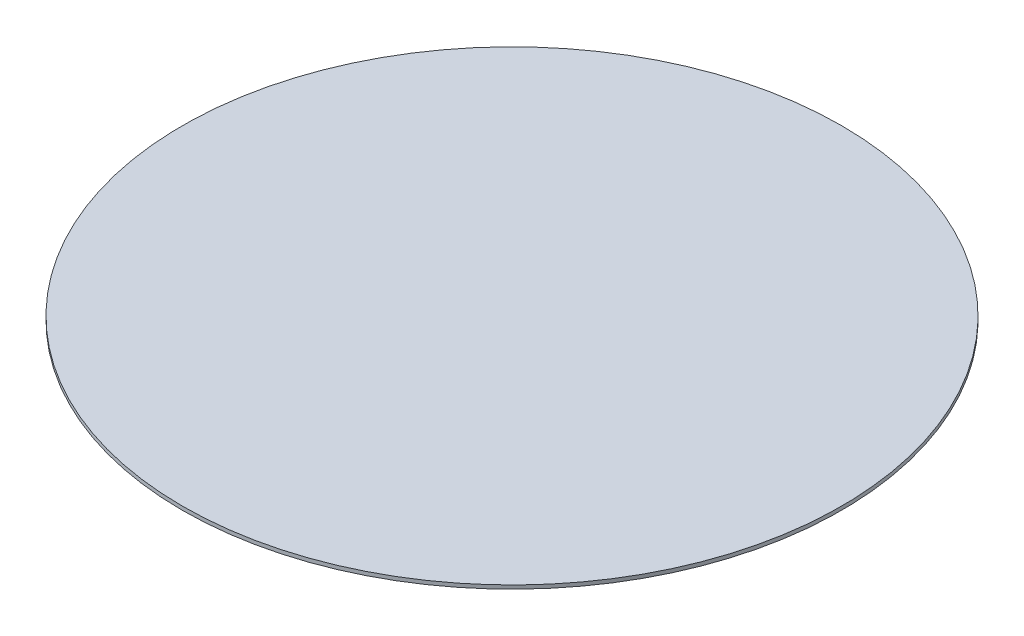
ISO-10303-21;
HEADER;
FILE_DESCRIPTION(('STEP AP214'),'2;1');
FILE_NAME('part.step','',(''),(''),'','','');
FILE_SCHEMA(('AUTOMOTIVE_DESIGN { 1 0 10303 214 1 1 1 1 }'));
ENDSEC;
DATA;
#1=APPLICATION_CONTEXT('core data for automotive mechanical design processes');
#2=APPLICATION_PROTOCOL_DEFINITION('international standard','automotive_design',2000,#1);
#3=PRODUCT_CONTEXT('',#1,'mechanical');
#4=PRODUCT('Part','Part','',(#3));
#5=PRODUCT_RELATED_PRODUCT_CATEGORY('part','',(#4));
#6=PRODUCT_DEFINITION_FORMATION('','',#4);
#7=PRODUCT_DEFINITION_CONTEXT('part definition',#1,'design');
#8=PRODUCT_DEFINITION('design','',#6,#7);
#9=PRODUCT_DEFINITION_SHAPE('','',#8);
#10=(LENGTH_UNIT() NAMED_UNIT(*) SI_UNIT(.MILLI.,.METRE.));
#11=(NAMED_UNIT(*) PLANE_ANGLE_UNIT() SI_UNIT($,.RADIAN.));
#12=(NAMED_UNIT(*) SI_UNIT($,.STERADIAN.) SOLID_ANGLE_UNIT());
#13=UNCERTAINTY_MEASURE_WITH_UNIT(LENGTH_MEASURE(1.E-05),#10,'distance_accuracy_value','');
#14=(GEOMETRIC_REPRESENTATION_CONTEXT(3) GLOBAL_UNCERTAINTY_ASSIGNED_CONTEXT((#13)) GLOBAL_UNIT_ASSIGNED_CONTEXT((#10,
#11,#12)) REPRESENTATION_CONTEXT('',''));
#15=CARTESIAN_POINT('',(0.,0.,0.));
#16=DIRECTION('',(0.,0.,1.));
#17=DIRECTION('',(1.,0.,0.));
#18=AXIS2_PLACEMENT_3D('',#15,#16,#17);
#19=CARTESIAN_POINT('',(0.,1.,0.));
#20=DIRECTION('',(0.,-1.,0.));
#21=DIRECTION('',(0.,0.,-1.));
#22=AXIS2_PLACEMENT_3D('',#19,#20,#21);
#23=CYLINDRICAL_SURFACE('',#22,90.);
#24=CARTESIAN_POINT('',(0.,1.,0.));
#25=DIRECTION('',(0.,1.,0.));
#26=DIRECTION('',(0.,0.,1.));
#27=AXIS2_PLACEMENT_3D('',#24,#25,#26);
#28=CIRCLE('',#27,90.);
#29=CARTESIAN_POINT('',(0.,1.,90.));
#30=VERTEX_POINT('',#29);
#31=EDGE_CURVE('E10',#30,#30,#28,.T.);
#32=ORIENTED_EDGE('',*,*,#31,.F.);
#33=EDGE_LOOP('',(#32));
#34=FACE_BOUND('',#33,.T.);
#35=CARTESIAN_POINT('',(0.,0.,0.));
#36=DIRECTION('',(0.,1.,0.));
#37=DIRECTION('',(0.,0.,1.));
#38=AXIS2_PLACEMENT_3D('',#35,#36,#37);
#39=CIRCLE('',#38,90.);
#40=CARTESIAN_POINT('',(0.,0.,90.));
#41=VERTEX_POINT('',#40);
#42=EDGE_CURVE('E34',#41,#41,#39,.T.);
#43=ORIENTED_EDGE('',*,*,#42,.T.);
#44=EDGE_LOOP('',(#43));
#45=FACE_BOUND('',#44,.T.);
#46=ADVANCED_FACE('F31',(#34,#45),#23,.T.);
#47=CARTESIAN_POINT('',(0.,1.,0.));
#48=DIRECTION('',(0.,1.,0.));
#49=DIRECTION('',(0.,0.,1.));
#50=AXIS2_PLACEMENT_3D('',#47,#48,#49);
#51=PLANE('',#50);
#52=ORIENTED_EDGE('',*,*,#31,.T.);
#53=EDGE_LOOP('',(#52));
#54=FACE_BOUND('',#53,.T.);
#55=ADVANCED_FACE('F46',(#54),#51,.T.);
#56=CARTESIAN_POINT('',(0.,0.,0.));
#57=DIRECTION('',(0.,1.,0.));
#58=DIRECTION('',(0.,0.,1.));
#59=AXIS2_PLACEMENT_3D('',#56,#57,#58);
#60=PLANE('',#59);
#61=ORIENTED_EDGE('',*,*,#42,.F.);
#62=EDGE_LOOP('',(#61));
#63=FACE_BOUND('',#62,.T.);
#64=ADVANCED_FACE('F44',(#63),#60,.F.);
#65=CLOSED_SHELL('',(#46,#55,#64));
#66=MANIFOLD_SOLID_BREP('B2',#65);
#67=ADVANCED_BREP_SHAPE_REPRESENTATION('',(#18,#66),#14);
#68=SHAPE_DEFINITION_REPRESENTATION(#9,#67);
ENDSEC;
END-ISO-10303-21;
